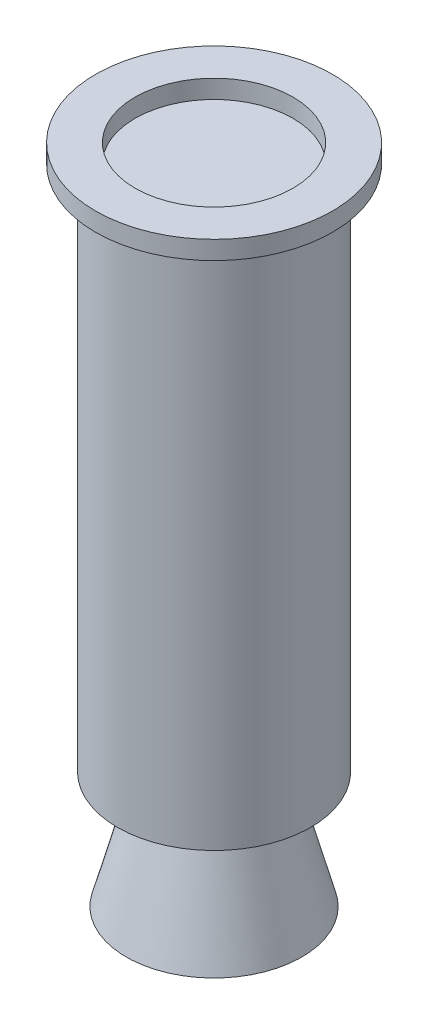
ISO-10303-21;
HEADER;
FILE_DESCRIPTION(('STEP AP214'),'2;1');
FILE_NAME('part.step','',(''),(''),'','','');
FILE_SCHEMA(('AUTOMOTIVE_DESIGN { 1 0 10303 214 1 1 1 1 }'));
ENDSEC;
DATA;
#1=APPLICATION_CONTEXT('core data for automotive mechanical design processes');
#2=APPLICATION_PROTOCOL_DEFINITION('international standard','automotive_design',2000,#1);
#3=PRODUCT_CONTEXT('',#1,'mechanical');
#4=PRODUCT('Part','Part','',(#3));
#5=PRODUCT_RELATED_PRODUCT_CATEGORY('part','',(#4));
#6=PRODUCT_DEFINITION_FORMATION('','',#4);
#7=PRODUCT_DEFINITION_CONTEXT('part definition',#1,'design');
#8=PRODUCT_DEFINITION('design','',#6,#7);
#9=PRODUCT_DEFINITION_SHAPE('','',#8);
#10=(LENGTH_UNIT() NAMED_UNIT(*) SI_UNIT(.MILLI.,.METRE.));
#11=(NAMED_UNIT(*) PLANE_ANGLE_UNIT() SI_UNIT($,.RADIAN.));
#12=(NAMED_UNIT(*) SI_UNIT($,.STERADIAN.) SOLID_ANGLE_UNIT());
#13=UNCERTAINTY_MEASURE_WITH_UNIT(LENGTH_MEASURE(1.E-05),#10,'distance_accuracy_value','');
#14=(GEOMETRIC_REPRESENTATION_CONTEXT(3) GLOBAL_UNCERTAINTY_ASSIGNED_CONTEXT((#13)) GLOBAL_UNIT_ASSIGNED_CONTEXT((#10,
#11,#12)) REPRESENTATION_CONTEXT('',''));
#15=CARTESIAN_POINT('',(0.,0.,0.));
#16=DIRECTION('',(0.,0.,1.));
#17=DIRECTION('',(1.,0.,0.));
#18=AXIS2_PLACEMENT_3D('',#15,#16,#17);
#19=CARTESIAN_POINT('',(34.7599897496612,-253.947859685097,0.));
#20=DIRECTION('',(0.,1.,0.));
#21=DIRECTION('',(0.,0.,1.));
#22=AXIS2_PLACEMENT_3D('',#19,#20,#21);
#23=PLANE('',#22);
#24=CARTESIAN_POINT('',(0.,-253.947859685097,0.));
#25=DIRECTION('',(0.,1.,0.));
#26=DIRECTION('',(0.,0.,1.));
#27=AXIS2_PLACEMENT_3D('',#24,#25,#26);
#28=CIRCLE('',#27,27.2303304900159);
#29=CARTESIAN_POINT('',(0.,-253.947859685097,27.2303304900159));
#30=VERTEX_POINT('',#29);
#31=EDGE_CURVE('E10',#30,#30,#28,.T.);
#32=ORIENTED_EDGE('',*,*,#31,.T.);
#33=EDGE_LOOP('',(#32));
#34=FACE_BOUND('',#33,.T.);
#35=CARTESIAN_POINT('',(0.,-253.947859685097,0.));
#36=DIRECTION('',(0.,1.,0.));
#37=DIRECTION('',(0.,0.,1.));
#38=AXIS2_PLACEMENT_3D('',#35,#36,#37);
#39=CIRCLE('',#38,46.584796967017);
#40=CARTESIAN_POINT('',(0.,-253.947859685097,46.584796967017));
#41=VERTEX_POINT('',#40);
#42=EDGE_CURVE('E123',#41,#41,#39,.T.);
#43=ORIENTED_EDGE('',*,*,#42,.F.);
#44=EDGE_LOOP('',(#43));
#45=FACE_BOUND('',#44,.T.);
#46=ADVANCED_FACE('F42',(#34,#45),#23,.F.);
#47=CARTESIAN_POINT('',(0.,0.,0.));
#48=DIRECTION('',(0.,1.,0.));
#49=DIRECTION('',(0.,0.,1.));
#50=AXIS2_PLACEMENT_3D('',#47,#48,#49);
#51=CYLINDRICAL_SURFACE('',#50,46.584796967017);
#52=CARTESIAN_POINT('',(0.,0.,0.));
#53=DIRECTION('',(0.,1.,0.));
#54=DIRECTION('',(0.,0.,1.));
#55=AXIS2_PLACEMENT_3D('',#52,#53,#54);
#56=CIRCLE('',#55,46.584796967017);
#57=CARTESIAN_POINT('',(0.,0.,46.584796967017));
#58=VERTEX_POINT('',#57);
#59=EDGE_CURVE('E127',#58,#58,#56,.T.);
#60=ORIENTED_EDGE('',*,*,#59,.F.);
#61=EDGE_LOOP('',(#60));
#62=FACE_BOUND('',#61,.T.);
#63=ORIENTED_EDGE('',*,*,#42,.T.);
#64=EDGE_LOOP('',(#63));
#65=FACE_BOUND('',#64,.T.);
#66=ADVANCED_FACE('F239',(#62,#65),#51,.T.);
#67=CARTESIAN_POINT('',(46.584796967017,0.,0.));
#68=DIRECTION('',(0.,1.,0.));
#69=DIRECTION('',(0.,0.,1.));
#70=AXIS2_PLACEMENT_3D('',#67,#68,#69);
#71=PLANE('',#70);
#72=CARTESIAN_POINT('',(0.,0.,0.));
#73=DIRECTION('',(0.,1.,0.));
#74=DIRECTION('',(0.,0.,1.));
#75=AXIS2_PLACEMENT_3D('',#72,#73,#74);
#76=CIRCLE('',#75,57.15);
#77=CARTESIAN_POINT('',(0.,0.,57.15));
#78=VERTEX_POINT('',#77);
#79=EDGE_CURVE('E131',#78,#78,#76,.T.);
#80=ORIENTED_EDGE('',*,*,#79,.F.);
#81=EDGE_LOOP('',(#80));
#82=FACE_BOUND('',#81,.T.);
#83=ORIENTED_EDGE('',*,*,#59,.T.);
#84=EDGE_LOOP('',(#83));
#85=FACE_BOUND('',#84,.T.);
#86=ADVANCED_FACE('F245',(#82,#85),#71,.F.);
#87=CARTESIAN_POINT('',(0.,0.,0.));
#88=DIRECTION('',(0.,1.,0.));
#89=DIRECTION('',(0.,0.,1.));
#90=AXIS2_PLACEMENT_3D('',#87,#88,#89);
#91=CYLINDRICAL_SURFACE('',#90,57.15);
#92=CARTESIAN_POINT('',(0.,8.89,0.));
#93=DIRECTION('',(0.,1.,0.));
#94=DIRECTION('',(0.,0.,1.));
#95=AXIS2_PLACEMENT_3D('',#92,#93,#94);
#96=CIRCLE('',#95,57.15);
#97=CARTESIAN_POINT('',(0.,8.89,57.15));
#98=VERTEX_POINT('',#97);
#99=EDGE_CURVE('E135',#98,#98,#96,.T.);
#100=ORIENTED_EDGE('',*,*,#99,.F.);
#101=EDGE_LOOP('',(#100));
#102=FACE_BOUND('',#101,.T.);
#103=ORIENTED_EDGE('',*,*,#79,.T.);
#104=EDGE_LOOP('',(#103));
#105=FACE_BOUND('',#104,.T.);
#106=ADVANCED_FACE('F252',(#102,#105),#91,.T.);
#107=CARTESIAN_POINT('',(38.1,8.89,0.));
#108=DIRECTION('',(0.,-1.,0.));
#109=DIRECTION('',(0.,0.,-1.));
#110=AXIS2_PLACEMENT_3D('',#107,#108,#109);
#111=PLANE('',#110);
#112=CARTESIAN_POINT('',(0.,8.89,0.));
#113=DIRECTION('',(0.,1.,0.));
#114=DIRECTION('',(0.,0.,1.));
#115=AXIS2_PLACEMENT_3D('',#112,#113,#114);
#116=CIRCLE('',#115,38.1);
#117=CARTESIAN_POINT('',(0.,8.89,38.1));
#118=VERTEX_POINT('',#117);
#119=EDGE_CURVE('E139',#118,#118,#116,.T.);
#120=ORIENTED_EDGE('',*,*,#119,.F.);
#121=EDGE_LOOP('',(#120));
#122=FACE_BOUND('',#121,.T.);
#123=ORIENTED_EDGE('',*,*,#99,.T.);
#124=EDGE_LOOP('',(#123));
#125=FACE_BOUND('',#124,.T.);
#126=ADVANCED_FACE('F171',(#122,#125),#111,.F.);
#127=CARTESIAN_POINT('',(0.,0.,0.));
#128=DIRECTION('',(0.,1.,0.));
#129=DIRECTION('',(0.,0.,1.));
#130=AXIS2_PLACEMENT_3D('',#127,#128,#129);
#131=CYLINDRICAL_SURFACE('',#130,38.1);
#132=CARTESIAN_POINT('',(0.,0.,0.));
#133=DIRECTION('',(0.,1.,0.));
#134=DIRECTION('',(0.,0.,1.));
#135=AXIS2_PLACEMENT_3D('',#132,#133,#134);
#136=CIRCLE('',#135,38.1);
#137=CARTESIAN_POINT('',(0.,0.,38.1));
#138=VERTEX_POINT('',#137);
#139=EDGE_CURVE('E119',#138,#138,#136,.T.);
#140=ORIENTED_EDGE('',*,*,#139,.F.);
#141=EDGE_LOOP('',(#140));
#142=FACE_BOUND('',#141,.T.);
#143=ORIENTED_EDGE('',*,*,#119,.T.);
#144=EDGE_LOOP('',(#143));
#145=FACE_BOUND('',#144,.T.);
#146=ADVANCED_FACE('F155',(#142,#145),#131,.F.);
#147=CARTESIAN_POINT('',(0.,-310.214421293795,42.3595497472853));
#148=DIRECTION('',(0.,1.,0.));
#149=DIRECTION('',(0.,0.,1.));
#150=AXIS2_PLACEMENT_3D('',#147,#148,#149);
#151=PLANE('',#150);
#152=CARTESIAN_POINT('',(0.,-310.214421293795,0.));
#153=DIRECTION('',(0.,-1.,0.));
#154=DIRECTION('',(0.,0.,-1.));
#155=AXIS2_PLACEMENT_3D('',#152,#153,#154);
#156=CIRCLE('',#155,42.3595497472853);
#157=CARTESIAN_POINT('',(0.,-310.214421293795,-42.3595497472853));
#158=VERTEX_POINT('',#157);
#159=EDGE_CURVE('E99',#158,#158,#156,.T.);
#160=ORIENTED_EDGE('',*,*,#159,.T.);
#161=EDGE_LOOP('',(#160));
#162=FACE_BOUND('',#161,.T.);
#163=ADVANCED_FACE('F170',(#162),#151,.F.);
#164=CARTESIAN_POINT('',(0.,-234.014421293795,0.));
#165=DIRECTION('',(0.,-1.,0.));
#166=DIRECTION('',(0.,0.,-1.));
#167=AXIS2_PLACEMENT_3D('',#164,#165,#166);
#168=CONICAL_SURFACE('',#167,21.8705332791861,0.262672052425151);
#169=ORIENTED_EDGE('',*,*,#159,.F.);
#170=EDGE_LOOP('',(#169));
#171=FACE_BOUND('',#170,.T.);
#172=ORIENTED_EDGE('',*,*,#31,.F.);
#173=EDGE_LOOP('',(#172));
#174=FACE_BOUND('',#173,.T.);
#175=ADVANCED_FACE('F192',(#171,#174),#168,.T.);
#176=CARTESIAN_POINT('',(0.,0.,0.));
#177=DIRECTION('',(0.,1.,0.));
#178=DIRECTION('',(0.,0.,1.));
#179=AXIS2_PLACEMENT_3D('',#176,#177,#178);
#180=PLANE('',#179);
#181=ORIENTED_EDGE('',*,*,#139,.T.);
#182=EDGE_LOOP('',(#181));
#183=FACE_BOUND('',#182,.T.);
#184=ADVANCED_FACE('F195',(#183),#180,.T.);
#185=CLOSED_SHELL('',(#46,#66,#86,#106,#126,#146,#163,#175,#184));
#186=CARTESIAN_POINT('',(27.2303304900159,-250.042041631034,0.));
#187=DIRECTION('',(0.,-1.,0.));
#188=DIRECTION('',(0.,0.,-1.));
#189=AXIS2_PLACEMENT_3D('',#186,#187,#188);
#190=PLANE('',#189);
#191=CARTESIAN_POINT('',(0.,-250.042041631034,0.));
#192=DIRECTION('',(0.,-1.,0.));
#193=DIRECTION('',(1.,0.,0.));
#194=AXIS2_PLACEMENT_3D('',#191,#192,#193);
#195=CIRCLE('',#194,34.7599897496613);
#196=CARTESIAN_POINT('',(34.7599897496613,-250.042041631034,0.));
#197=VERTEX_POINT('',#196);
#198=EDGE_CURVE('E107',#197,#197,#195,.T.);
#199=ORIENTED_EDGE('',*,*,#198,.T.);
#200=EDGE_LOOP('',(#199));
#201=FACE_BOUND('',#200,.T.);
#202=CARTESIAN_POINT('',(0.,-250.042041631034,0.));
#203=DIRECTION('',(0.,1.,0.));
#204=DIRECTION('',(0.,0.,1.));
#205=AXIS2_PLACEMENT_3D('',#202,#203,#204);
#206=CIRCLE('',#205,38.1);
#207=CARTESIAN_POINT('',(0.,-250.042041631034,38.1));
#208=VERTEX_POINT('',#207);
#209=EDGE_CURVE('E143',#208,#208,#206,.T.);
#210=ORIENTED_EDGE('',*,*,#209,.T.);
#211=EDGE_LOOP('',(#210));
#212=FACE_BOUND('',#211,.T.);
#213=ADVANCED_FACE('F148',(#201,#212),#190,.F.);
#214=CARTESIAN_POINT('',(0.,-160.995333166454,0.));
#215=DIRECTION('',(0.,1.,0.));
#216=DIRECTION('',(0.,0.,1.));
#217=AXIS2_PLACEMENT_3D('',#214,#215,#216);
#218=CIRCLE('',#217,38.1);
#219=CARTESIAN_POINT('',(0.,-160.995333166454,38.1));
#220=VERTEX_POINT('',#219);
#221=EDGE_CURVE('E115',#220,#220,#218,.F.);
#222=ORIENTED_EDGE('',*,*,#221,.F.);
#223=EDGE_LOOP('',(#222));
#224=FACE_BOUND('',#223,.T.);
#225=ORIENTED_EDGE('',*,*,#209,.F.);
#226=EDGE_LOOP('',(#225));
#227=FACE_BOUND('',#226,.T.);
#228=ADVANCED_FACE('F150',(#224,#227),#131,.F.);
#229=CARTESIAN_POINT('',(0.,-221.211557003159,0.));
#230=DIRECTION('',(0.,-1.,0.));
#231=DIRECTION('',(1.,0.,0.));
#232=AXIS2_PLACEMENT_3D('',#229,#230,#231);
#233=CYLINDRICAL_SURFACE('',#232,34.7599897496613);
#234=ORIENTED_EDGE('',*,*,#198,.F.);
#235=EDGE_LOOP('',(#234));
#236=FACE_BOUND('',#235,.T.);
#237=CARTESIAN_POINT('',(0.,-170.032041631034,0.));
#238=DIRECTION('',(0.,-1.,0.));
#239=DIRECTION('',(1.,0.,0.));
#240=AXIS2_PLACEMENT_3D('',#237,#238,#239);
#241=CIRCLE('',#240,34.7599897496612);
#242=CARTESIAN_POINT('',(34.7599897496613,-170.032041631034,0.));
#243=VERTEX_POINT('',#242);
#244=EDGE_CURVE('E111',#243,#243,#241,.T.);
#245=ORIENTED_EDGE('',*,*,#244,.T.);
#246=EDGE_LOOP('',(#245));
#247=FACE_BOUND('',#246,.T.);
#248=ADVANCED_FACE('F152',(#236,#247),#233,.T.);
#249=CARTESIAN_POINT('',(0.,-196.634205844844,0.));
#250=DIRECTION('',(0.,1.,0.));
#251=DIRECTION('',(0.,0.,1.));
#252=AXIS2_PLACEMENT_3D('',#249,#250,#251);
#253=CONICAL_SURFACE('',#252,24.9277038566754,0.354032206575372);
#254=ORIENTED_EDGE('',*,*,#244,.F.);
#255=EDGE_LOOP('',(#254));
#256=FACE_BOUND('',#255,.T.);
#257=ORIENTED_EDGE('',*,*,#221,.T.);
#258=EDGE_LOOP('',(#257));
#259=FACE_BOUND('',#258,.T.);
#260=ADVANCED_FACE('F161',(#256,#259),#253,.T.);
#261=CLOSED_SHELL('',(#213,#228,#248,#260));
#262=CARTESIAN_POINT('',(0.,-221.89361316894,0.));
#263=DIRECTION('',(0.,-1.,0.));
#264=DIRECTION('',(0.,0.,-1.));
#265=AXIS2_PLACEMENT_3D('',#262,#263,#264);
#266=TOROIDAL_SURFACE('',#265,70.3930065397314,51.663710814071);
#267=CARTESIAN_POINT('',(0.,-217.424,0.));
#268=DIRECTION('',(0.,-1.,0.));
#269=DIRECTION('',(0.,0.,-1.));
#270=AXIS2_PLACEMENT_3D('',#267,#268,#269);
#271=CIRCLE('',#270,18.923);
#272=CARTESIAN_POINT('',(0.,-217.424,-18.923));
#273=VERTEX_POINT('',#272);
#274=EDGE_CURVE('E61',#273,#273,#271,.T.);
#275=ORIENTED_EDGE('',*,*,#274,.F.);
#276=EDGE_LOOP('',(#275));
#277=FACE_BOUND('',#276,.T.);
#278=CARTESIAN_POINT('',(0.,-217.418000796486,0.));
#279=DIRECTION('',(0.,-1.,0.));
#280=DIRECTION('',(0.,0.,-1.));
#281=AXIS2_PLACEMENT_3D('',#278,#279,#280);
#282=CIRCLE('',#281,18.9235213181801);
#283=CARTESIAN_POINT('',(0.,-217.418000796486,-18.9235213181801));
#284=VERTEX_POINT('',#283);
#285=EDGE_CURVE('E64',#284,#284,#282,.T.);
#286=ORIENTED_EDGE('',*,*,#285,.T.);
#287=EDGE_LOOP('',(#286));
#288=FACE_BOUND('',#287,.T.);
#289=ADVANCED_FACE('F227',(#277,#288),#266,.F.);
#290=CARTESIAN_POINT('',(0.,-217.79080122298,0.));
#291=DIRECTION('',(0.,-1.,0.));
#292=DIRECTION('',(0.,0.,-1.));
#293=AXIS2_PLACEMENT_3D('',#290,#291,#292);
#294=TOROIDAL_SURFACE('',#293,23.1469139343741,4.23981038045092);
#295=ORIENTED_EDGE('',*,*,#274,.T.);
#296=EDGE_LOOP('',(#295));
#297=FACE_BOUND('',#296,.T.);
#298=CARTESIAN_POINT('',(0.,-218.163557003158,0.));
#299=DIRECTION('',(0.,1.,0.));
#300=DIRECTION('',(0.,0.,1.));
#301=AXIS2_PLACEMENT_3D('',#298,#299,#300);
#302=CIRCLE('',#301,18.9235213181801);
#303=CARTESIAN_POINT('',(0.,-218.163557003158,18.9235213181801));
#304=VERTEX_POINT('',#303);
#305=EDGE_CURVE('E68',#304,#304,#302,.T.);
#306=ORIENTED_EDGE('',*,*,#305,.T.);
#307=EDGE_LOOP('',(#306));
#308=FACE_BOUND('',#307,.T.);
#309=ADVANCED_FACE('F211',(#297,#308),#294,.F.);
#310=CARTESIAN_POINT('',(0.,-217.424,0.));
#311=DIRECTION('',(0.,1.,0.));
#312=DIRECTION('',(0.,0.,1.));
#313=AXIS2_PLACEMENT_3D('',#310,#311,#312);
#314=CYLINDRICAL_SURFACE('',#313,18.9235213181801);
#315=ORIENTED_EDGE('',*,*,#305,.F.);
#316=EDGE_LOOP('',(#315));
#317=FACE_BOUND('',#316,.T.);
#318=ORIENTED_EDGE('',*,*,#285,.F.);
#319=EDGE_LOOP('',(#318));
#320=FACE_BOUND('',#319,.T.);
#321=ADVANCED_FACE('F209',(#317,#320),#314,.F.);
#322=CLOSED_SHELL('',(#289,#309,#321));
#323=CARTESIAN_POINT('',(0.,-221.211557003159,0.));
#324=DIRECTION('',(0.,-1.,0.));
#325=DIRECTION('',(1.,0.,0.));
#326=AXIS2_PLACEMENT_3D('',#323,#324,#325);
#327=CYLINDRICAL_SURFACE('',#326,21.8705332791861);
#328=CARTESIAN_POINT('',(0.,-204.745135906312,0.));
#329=DIRECTION('',(0.,-1.,0.));
#330=DIRECTION('',(1.,0.,0.));
#331=AXIS2_PLACEMENT_3D('',#328,#329,#330);
#332=CIRCLE('',#331,21.8705332791861);
#333=CARTESIAN_POINT('',(21.8705332791861,-204.745135906312,0.));
#334=VERTEX_POINT('',#333);
#335=EDGE_CURVE('E103',#334,#334,#332,.T.);
#336=ORIENTED_EDGE('',*,*,#335,.F.);
#337=EDGE_LOOP('',(#336));
#338=FACE_BOUND('',#337,.T.);
#339=CARTESIAN_POINT('',(0.,-234.014421293795,0.));
#340=DIRECTION('',(0.,1.,0.));
#341=DIRECTION('',(0.,0.,1.));
#342=AXIS2_PLACEMENT_3D('',#339,#340,#341);
#343=CIRCLE('',#342,21.8705332791861);
#344=CARTESIAN_POINT('',(0.,-234.014421293795,21.8705332791861));
#345=VERTEX_POINT('',#344);
#346=EDGE_CURVE('E51',#345,#345,#343,.F.);
#347=ORIENTED_EDGE('',*,*,#346,.T.);
#348=EDGE_LOOP('',(#347));
#349=FACE_BOUND('',#348,.T.);
#350=ADVANCED_FACE('F177',(#338,#349),#327,.F.);
#351=CARTESIAN_POINT('',(20.9555213181801,-221.211557003159,0.));
#352=DIRECTION('',(0.,1.,0.));
#353=DIRECTION('',(0.,0.,1.));
#354=AXIS2_PLACEMENT_3D('',#351,#352,#353);
#355=PLANE('',#354);
#356=CARTESIAN_POINT('',(0.,-221.211557003159,0.));
#357=DIRECTION('',(0.,1.,0.));
#358=DIRECTION('',(0.,0.,1.));
#359=AXIS2_PLACEMENT_3D('',#356,#357,#358);
#360=CIRCLE('',#359,19.6763327928601);
#361=CARTESIAN_POINT('',(0.,-221.211557003159,19.6763327928601));
#362=VERTEX_POINT('',#361);
#363=EDGE_CURVE('E73',#362,#362,#360,.F.);
#364=ORIENTED_EDGE('',*,*,#363,.F.);
#365=EDGE_LOOP('',(#364));
#366=FACE_BOUND('',#365,.T.);
#367=CARTESIAN_POINT('',(0.,-221.211557003159,0.));
#368=DIRECTION('',(0.,1.,0.));
#369=DIRECTION('',(0.,0.,1.));
#370=AXIS2_PLACEMENT_3D('',#367,#368,#369);
#371=CIRCLE('',#370,20.9555213181801);
#372=CARTESIAN_POINT('',(0.,-221.211557003159,20.9555213181801));
#373=VERTEX_POINT('',#372);
#374=EDGE_CURVE('E95',#373,#373,#371,.T.);
#375=ORIENTED_EDGE('',*,*,#374,.F.);
#376=EDGE_LOOP('',(#375));
#377=FACE_BOUND('',#376,.T.);
#378=ADVANCED_FACE('F179',(#366,#377),#355,.F.);
#379=CARTESIAN_POINT('',(0.,-223.971772387611,0.));
#380=DIRECTION('',(0.,-1.,0.));
#381=DIRECTION('',(0.,0.,-1.));
#382=AXIS2_PLACEMENT_3D('',#379,#380,#381);
#383=CONICAL_SURFACE('',#382,20.4185516338979,0.262685253079921);
#384=CARTESIAN_POINT('',(0.,-223.971772387611,0.));
#385=DIRECTION('',(0.,-1.,0.));
#386=DIRECTION('',(0.,0.,-1.));
#387=AXIS2_PLACEMENT_3D('',#384,#385,#386);
#388=CIRCLE('',#387,20.4185516338979);
#389=CARTESIAN_POINT('',(0.,-223.971772387611,-20.4185516338979));
#390=VERTEX_POINT('',#389);
#391=EDGE_CURVE('E85',#390,#390,#388,.T.);
#392=ORIENTED_EDGE('',*,*,#391,.F.);
#393=EDGE_LOOP('',(#392));
#394=FACE_BOUND('',#393,.T.);
#395=ORIENTED_EDGE('',*,*,#363,.T.);
#396=EDGE_LOOP('',(#395));
#397=FACE_BOUND('',#396,.T.);
#398=ADVANCED_FACE('F187',(#394,#397),#383,.T.);
#399=CARTESIAN_POINT('',(0.,-224.284848568572,0.));
#400=DIRECTION('',(0.,1.,0.));
#401=DIRECTION('',(0.,0.,1.));
#402=AXIS2_PLACEMENT_3D('',#399,#400,#401);
#403=CONICAL_SURFACE('',#402,19.2542620155074,1.308111073715);
#404=ORIENTED_EDGE('',*,*,#391,.T.);
#405=EDGE_LOOP('',(#404));
#406=FACE_BOUND('',#405,.T.);
#407=CARTESIAN_POINT('',(0.,-224.284848568572,0.));
#408=DIRECTION('',(0.,1.,0.));
#409=DIRECTION('',(0.,0.,1.));
#410=AXIS2_PLACEMENT_3D('',#407,#408,#409);
#411=CIRCLE('',#410,19.2542620155074);
#412=CARTESIAN_POINT('',(0.,-224.284848568572,19.2542620155074));
#413=VERTEX_POINT('',#412);
#414=EDGE_CURVE('E56',#413,#413,#411,.T.);
#415=ORIENTED_EDGE('',*,*,#414,.T.);
#416=EDGE_LOOP('',(#415));
#417=FACE_BOUND('',#416,.T.);
#418=ADVANCED_FACE('F215',(#406,#417),#403,.T.);
#419=CARTESIAN_POINT('',(0.,-219.204848568572,0.));
#420=DIRECTION('',(0.,-1.,0.));
#421=DIRECTION('',(0.,0.,-1.));
#422=AXIS2_PLACEMENT_3D('',#419,#420,#421);
#423=CONICAL_SURFACE('',#422,17.8882556763972,0.262685253079923);
#424=ORIENTED_EDGE('',*,*,#346,.F.);
#425=EDGE_LOOP('',(#424));
#426=FACE_BOUND('',#425,.T.);
#427=ORIENTED_EDGE('',*,*,#414,.F.);
#428=EDGE_LOOP('',(#427));
#429=FACE_BOUND('',#428,.T.);
#430=ADVANCED_FACE('F44',(#426,#429),#423,.T.);
#431=CARTESIAN_POINT('',(0.,-217.424,0.));
#432=DIRECTION('',(0.,1.,0.));
#433=DIRECTION('',(0.,0.,1.));
#434=AXIS2_PLACEMENT_3D('',#431,#432,#433);
#435=CYLINDRICAL_SURFACE('',#434,20.9555213181801);
#436=CARTESIAN_POINT('',(0.,-213.083557003159,0.));
#437=DIRECTION('',(0.,1.,0.));
#438=DIRECTION('',(0.,0.,1.));
#439=AXIS2_PLACEMENT_3D('',#436,#437,#438);
#440=CIRCLE('',#439,20.9555213181801);
#441=CARTESIAN_POINT('',(0.,-213.083557003159,20.9555213181801));
#442=VERTEX_POINT('',#441);
#443=EDGE_CURVE('E76',#442,#442,#440,.T.);
#444=ORIENTED_EDGE('',*,*,#443,.F.);
#445=EDGE_LOOP('',(#444));
#446=FACE_BOUND('',#445,.T.);
#447=ORIENTED_EDGE('',*,*,#374,.T.);
#448=EDGE_LOOP('',(#447));
#449=FACE_BOUND('',#448,.T.);
#450=ADVANCED_FACE('F200',(#446,#449),#435,.T.);
#451=CARTESIAN_POINT('',(18.9235213181801,-213.083557003159,0.));
#452=DIRECTION('',(0.,-1.,0.));
#453=DIRECTION('',(0.,0.,-1.));
#454=AXIS2_PLACEMENT_3D('',#451,#452,#453);
#455=PLANE('',#454);
#456=CARTESIAN_POINT('',(0.,-213.083557003159,0.));
#457=DIRECTION('',(0.,1.,0.));
#458=DIRECTION('',(0.,0.,1.));
#459=AXIS2_PLACEMENT_3D('',#456,#457,#458);
#460=CIRCLE('',#459,19.4860136464586);
#461=CARTESIAN_POINT('',(0.,-213.083557003159,19.4860136464586));
#462=VERTEX_POINT('',#461);
#463=EDGE_CURVE('E69',#462,#462,#460,.T.);
#464=ORIENTED_EDGE('',*,*,#463,.F.);
#465=EDGE_LOOP('',(#464));
#466=FACE_BOUND('',#465,.T.);
#467=ORIENTED_EDGE('',*,*,#443,.T.);
#468=EDGE_LOOP('',(#467));
#469=FACE_BOUND('',#468,.T.);
#470=ADVANCED_FACE('F203',(#466,#469),#455,.F.);
#471=CARTESIAN_POINT('',(0.,-208.113159893059,0.));
#472=DIRECTION('',(0.,-1.,0.));
#473=DIRECTION('',(0.,0.,-1.));
#474=AXIS2_PLACEMENT_3D('',#471,#472,#473);
#475=CIRCLE('',#474,20.6010581686222);
#476=CARTESIAN_POINT('',(0.,-208.113159893059,-20.6010581686222));
#477=VERTEX_POINT('',#476);
#478=EDGE_CURVE('E81',#477,#477,#475,.T.);
#479=ORIENTED_EDGE('',*,*,#478,.T.);
#480=EDGE_LOOP('',(#479));
#481=FACE_BOUND('',#480,.T.);
#482=ORIENTED_EDGE('',*,*,#463,.T.);
#483=EDGE_LOOP('',(#482));
#484=FACE_BOUND('',#483,.T.);
#485=ADVANCED_FACE('F207',(#481,#484),#266,.F.);
#486=CARTESIAN_POINT('',(0.,-208.113159893059,0.));
#487=DIRECTION('',(0.,1.,0.));
#488=DIRECTION('',(0.,0.,1.));
#489=AXIS2_PLACEMENT_3D('',#486,#487,#488);
#490=CONICAL_SURFACE('',#489,20.6010581686222,0.360452766955377);
#491=ORIENTED_EDGE('',*,*,#478,.F.);
#492=EDGE_LOOP('',(#491));
#493=FACE_BOUND('',#492,.T.);
#494=ORIENTED_EDGE('',*,*,#335,.T.);
#495=EDGE_LOOP('',(#494));
#496=FACE_BOUND('',#495,.T.);
#497=ADVANCED_FACE('F223',(#493,#496),#490,.T.);
#498=CLOSED_SHELL('',(#350,#378,#398,#418,#430,#450,#470,#485,#497));
#499=ORIENTED_CLOSED_SHELL('',*,#261,.T.);
#500=ORIENTED_CLOSED_SHELL('',*,#322,.T.);
#501=ORIENTED_CLOSED_SHELL('',*,#498,.T.);
#502=BREP_WITH_VOIDS('B2',#185,(#499,#500,#501));
#503=ADVANCED_BREP_SHAPE_REPRESENTATION('',(#18,#502),#14);
#504=SHAPE_DEFINITION_REPRESENTATION(#9,#503);
ENDSEC;
END-ISO-10303-21;
